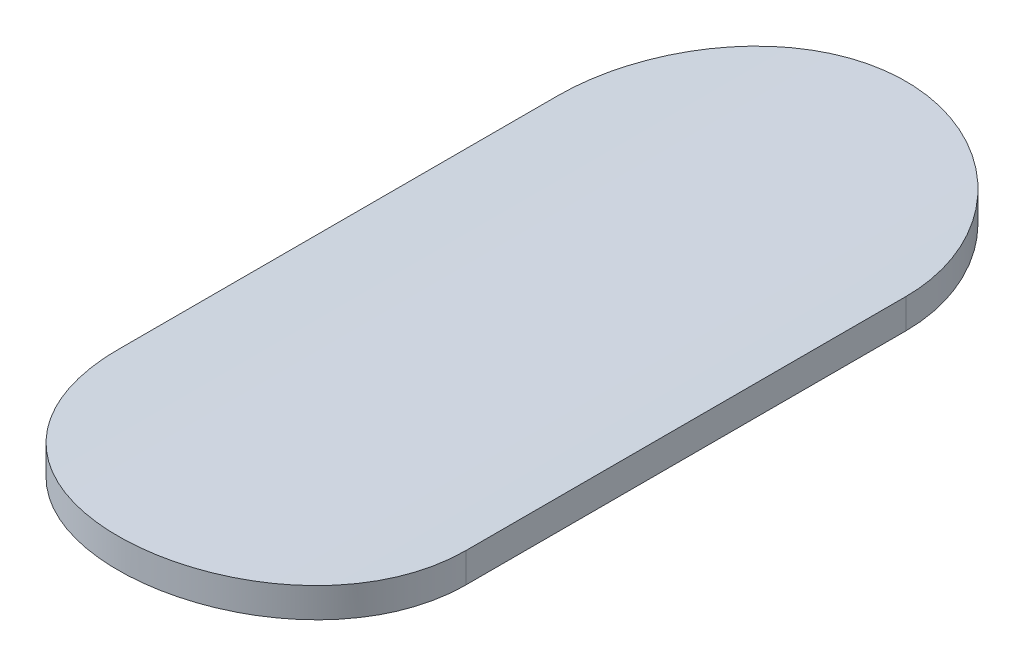
ISO-10303-21;
HEADER;
FILE_DESCRIPTION(('STEP AP214'),'2;1');
FILE_NAME('part.step','',(''),(''),'','','');
FILE_SCHEMA(('AUTOMOTIVE_DESIGN { 1 0 10303 214 1 1 1 1 }'));
ENDSEC;
DATA;
#1=APPLICATION_CONTEXT('core data for automotive mechanical design processes');
#2=APPLICATION_PROTOCOL_DEFINITION('international standard','automotive_design',2000,#1);
#3=PRODUCT_CONTEXT('',#1,'mechanical');
#4=PRODUCT('Part','Part','',(#3));
#5=PRODUCT_RELATED_PRODUCT_CATEGORY('part','',(#4));
#6=PRODUCT_DEFINITION_FORMATION('','',#4);
#7=PRODUCT_DEFINITION_CONTEXT('part definition',#1,'design');
#8=PRODUCT_DEFINITION('design','',#6,#7);
#9=PRODUCT_DEFINITION_SHAPE('','',#8);
#10=(LENGTH_UNIT() NAMED_UNIT(*) SI_UNIT(.MILLI.,.METRE.));
#11=(NAMED_UNIT(*) PLANE_ANGLE_UNIT() SI_UNIT($,.RADIAN.));
#12=(NAMED_UNIT(*) SI_UNIT($,.STERADIAN.) SOLID_ANGLE_UNIT());
#13=UNCERTAINTY_MEASURE_WITH_UNIT(LENGTH_MEASURE(1.E-05),#10,'distance_accuracy_value','');
#14=(GEOMETRIC_REPRESENTATION_CONTEXT(3) GLOBAL_UNCERTAINTY_ASSIGNED_CONTEXT((#13)) GLOBAL_UNIT_ASSIGNED_CONTEXT((#10,
#11,#12)) REPRESENTATION_CONTEXT('',''));
#15=CARTESIAN_POINT('',(0.,0.,0.));
#16=DIRECTION('',(0.,0.,1.));
#17=DIRECTION('',(1.,0.,0.));
#18=AXIS2_PLACEMENT_3D('',#15,#16,#17);
#19=CARTESIAN_POINT('',(-175.270710986936,-62.9180736437962,1.42682282483736));
#20=DIRECTION('',(0.,0.,1.));
#21=DIRECTION('',(1.,0.,0.));
#22=AXIS2_PLACEMENT_3D('',#19,#20,#21);
#23=CYLINDRICAL_SURFACE('',#22,5.);
#24=DIRECTION('',(0.,0.,1.));
#25=VECTOR('',#24,1.);
#26=CARTESIAN_POINT('',(-174.562352982167,-57.9685050830953,5.32081992476387));
#27=LINE('',#26,#25);
#28=CARTESIAN_POINT('',(-174.562352982167,-57.9685050830953,5.32081992476387));
#29=VERTEX_POINT('',#28);
#30=CARTESIAN_POINT('',(-174.562352982167,-57.9685050830953,3.52987704480574));
#31=VERTEX_POINT('',#30);
#32=EDGE_CURVE('E72',#29,#31,#27,.F.);
#33=ORIENTED_EDGE('',*,*,#32,.T.);
#34=CARTESIAN_POINT('',(-175.979068991686,-57.9685050830924,3.52987704480574));
#35=CARTESIAN_POINT('',(-175.979103782239,-57.9685236247254,3.49023832453206));
#36=CARTESIAN_POINT('',(-175.975743993142,-57.9680294172961,3.45061425502313));
#37=CARTESIAN_POINT('',(-175.962497293196,-57.966153634488,3.37253870868182));
#38=CARTESIAN_POINT('',(-175.952617865063,-57.96477307644,3.3340859403917));
#39=CARTESIAN_POINT('',(-175.926588847079,-57.9612615989124,3.25938899672191));
#40=CARTESIAN_POINT('',(-175.910437338651,-57.9591304498517,3.22314550106919));
#41=CARTESIAN_POINT('',(-175.872343788952,-57.9543645974186,3.15388484997992));
#42=CARTESIAN_POINT('',(-175.850402245911,-57.9517299373782,3.12086741727733));
#43=CARTESIAN_POINT('',(-175.801186212379,-57.9462318835381,3.05876469671133));
#44=CARTESIAN_POINT('',(-175.773879485931,-57.9433671722797,3.02970507030449));
#45=CARTESIAN_POINT('',(-175.714767078786,-57.9377429193244,2.97655491580581));
#46=CARTESIAN_POINT('',(-175.682959727318,-57.9349834171695,2.9524662412866));
#47=CARTESIAN_POINT('',(-175.615578010275,-57.9298662750011,2.90984890980622));
#48=CARTESIAN_POINT('',(-175.579986710165,-57.9275105763355,2.89134680394256));
#49=CARTESIAN_POINT('',(-175.50618961077,-57.923485599968,2.86061259257316));
#50=CARTESIAN_POINT('',(-175.46798693738,-57.9218155177829,2.84837313447103));
#51=CARTESIAN_POINT('',(-175.403100429486,-57.9197589158793,2.83349071746208));
#52=CARTESIAN_POINT('',(-175.376831486473,-57.9191299886342,2.82900786755084));
#53=CARTESIAN_POINT('',(-175.323949150309,-57.9182871387536,2.82302143781597));
#54=CARTESIAN_POINT('',(-175.297335753281,-57.9180732207935,2.821517891557));
#55=CARTESIAN_POINT('',(-175.23113654507,-57.9180742725377,2.82152074713416));
#56=CARTESIAN_POINT('',(-175.191536984771,-57.9185484483598,2.82484680154109));
#57=CARTESIAN_POINT('',(-175.113441963008,-57.9203944948015,2.83806121489377));
#58=CARTESIAN_POINT('',(-175.074947697749,-57.9217673023731,2.84795642327375));
#59=CARTESIAN_POINT('',(-175.00020677382,-57.9252561689579,2.8740088677535));
#60=CARTESIAN_POINT('',(-174.963958447437,-57.9273716685143,2.89016139127343));
#61=CARTESIAN_POINT('',(-174.894692648647,-57.9321116511947,2.92825947150867));
#62=CARTESIAN_POINT('',(-174.861674711803,-57.9347360609899,2.9502041937914));
#63=CARTESIAN_POINT('',(-174.799570755551,-57.9402220719575,2.99942664621903));
#64=CARTESIAN_POINT('',(-174.770510529491,-57.9430850497234,3.02673676787919));
#65=CARTESIAN_POINT('',(-174.717368000384,-57.9487147875815,3.08584760976762));
#66=CARTESIAN_POINT('',(-174.693286168052,-57.9514815385548,3.11764875415215));
#67=CARTESIAN_POINT('',(-174.6506815258,-57.9566194521665,3.18501383702313));
#68=CARTESIAN_POINT('',(-174.632184904988,-57.9589887286848,3.2205944762896));
#69=CARTESIAN_POINT('',(-174.601448250876,-57.9630429435686,3.29439116564338));
#70=CARTESIAN_POINT('',(-174.589204591519,-57.9647282784312,3.33260567373841));
#71=CARTESIAN_POINT('',(-174.57431847833,-57.966803740856,3.39751872626204));
#72=CARTESIAN_POINT('',(-174.569835231589,-57.9674384398505,3.42380208033447));
#73=CARTESIAN_POINT('',(-174.563852298162,-57.9682904852839,3.47667870746524));
#74=CARTESIAN_POINT('',(-174.562348814522,-57.9685083628437,3.50327154262447));
#75=CARTESIAN_POINT('',(-174.562352982166,-57.9685050830953,3.52987704480573));
#76=B_SPLINE_CURVE_WITH_KNOTS('',3,(#34,#35,#36,#37,#38,#39,#40,#41,#42,#43,#44,#45,#46,#47,#48,
#49,#50,#51,#52,#53,#54,#55,#56,#57,#58,#59,#60,#61,#62,#63,#64,#65,#66,#67,#68,#69,#70,#71,#72,
#73,#74,#75),.UNSPECIFIED.,.F.,.F.,(4,2,2,2,2,2,2,2,2,2,2,2,2,2,2,2,2,2,2,2,4),(0.,
0.118749159033301,0.237362263863266,0.356011680082907,0.474650889915931,0.594026017222665,
0.713445577112569,0.833424074530632,0.953261387365861,1.03306921841363,1.11287794856634,
1.23150381401026,1.35025356129366,1.46891404775443,1.58755744913422,1.70694043541029,
1.82633470440586,1.94628041824212,2.0661564970343,2.14600710616939,2.22575590036766),.UNSPECIFIED.);
#77=CARTESIAN_POINT('',(-175.979068991686,-57.9685050830924,3.52987704480574));
#78=VERTEX_POINT('',#77);
#79=EDGE_CURVE('E21',#78,#31,#76,.T.);
#80=ORIENTED_EDGE('',*,*,#79,.F.);
#81=DIRECTION('',(0.,0.,1.));
#82=VECTOR('',#81,1.);
#83=CARTESIAN_POINT('',(-175.979068991686,-57.9685050830924,3.52987704480574));
#84=LINE('',#83,#82);
#85=CARTESIAN_POINT('',(-175.979068991686,-57.9685050830924,5.32081992476387));
#86=VERTEX_POINT('',#85);
#87=EDGE_CURVE('E59',#78,#86,#84,.T.);
#88=ORIENTED_EDGE('',*,*,#87,.T.);
#89=CARTESIAN_POINT('',(-174.562352982166,-57.9685050830953,5.32081992476387));
#90=CARTESIAN_POINT('',(-174.562318196855,-57.9685236249812,5.36045875118215));
#91=CARTESIAN_POINT('',(-174.565678001328,-57.9680294147793,5.40008292658639));
#92=CARTESIAN_POINT('',(-174.578924730807,-57.9661536270469,5.4781584669726));
#93=CARTESIAN_POINT('',(-174.588804138273,-57.9647730715819,5.51661112942718));
#94=CARTESIAN_POINT('',(-174.614832862514,-57.961261635449,5.5913071988421));
#95=CARTESIAN_POINT('',(-174.630983984776,-57.9591305387335,5.62754996614367));
#96=CARTESIAN_POINT('',(-174.669077252271,-57.9543647067664,5.69681074350064));
#97=CARTESIAN_POINT('',(-174.69101913913,-57.9517299939867,5.72982889734272));
#98=CARTESIAN_POINT('',(-174.740238554018,-57.9462315808069,5.79193570801102));
#99=CARTESIAN_POINT('',(-174.767548788613,-57.9433665437922,5.82099833037872));
#100=CARTESIAN_POINT('',(-174.826661623317,-57.9377423080897,5.8741473371765));
#101=CARTESIAN_POINT('',(-174.858464907965,-57.9349831256108,5.89823296195578));
#102=CARTESIAN_POINT('',(-174.92582690985,-57.9298676599314,5.94083672096566));
#103=CARTESIAN_POINT('',(-174.961401022296,-57.92751314,5.95933074329458));
#104=CARTESIAN_POINT('',(-175.035187236117,-57.923487367333,5.99007073367099));
#105=CARTESIAN_POINT('',(-175.073399058509,-57.9218160424669,6.00231736133994));
#106=CARTESIAN_POINT('',(-175.151106698599,-57.9193542972137,6.02013689817477));
#107=CARTESIAN_POINT('',(-175.190592217577,-57.9185580590577,6.02575390124894));
#108=CARTESIAN_POINT('',(-175.269953805239,-57.9179162798542,6.03029159454111));
#109=CARTESIAN_POINT('',(-175.309829863807,-57.9180707142472,6.02921245774644));
#110=CARTESIAN_POINT('',(-175.388537947523,-57.9193082454885,6.02042324927957));
#111=CARTESIAN_POINT('',(-175.427375409613,-57.920384673506,6.01276079389286));
#112=CARTESIAN_POINT('',(-175.503207417969,-57.9233377917455,5.99109712979044));
#113=CARTESIAN_POINT('',(-175.540201931684,-57.9252144960957,5.97709580916648));
#114=CARTESIAN_POINT('',(-175.611444073484,-57.9295688237722,5.94310217437236));
#115=CARTESIAN_POINT('',(-175.645681859745,-57.9320484831862,5.92308950574416));
#116=CARTESIAN_POINT('',(-175.710329759436,-57.9373318406016,5.87765687959292));
#117=CARTESIAN_POINT('',(-175.74073980229,-57.9401355445759,5.85223682239285));
#118=CARTESIAN_POINT('',(-175.797147098611,-57.9457827135757,5.79644921190766));
#119=CARTESIAN_POINT('',(-175.82310390147,-57.948626312746,5.76604076055398));
#120=CARTESIAN_POINT('',(-175.869559674625,-57.9540098748136,5.7012667126286));
#121=CARTESIAN_POINT('',(-175.890057049346,-57.9565497488248,5.66689996339818));
#122=CARTESIAN_POINT('',(-175.925016270059,-57.961038558067,5.59514016548331));
#123=CARTESIAN_POINT('',(-175.939470714414,-57.9629867678086,5.55774347210168));
#124=CARTESIAN_POINT('',(-175.961861661342,-57.9660598482314,5.48104617640931));
#125=CARTESIAN_POINT('',(-175.969807949566,-57.9671859547474,5.44174852695425));
#126=CARTESIAN_POINT('',(-175.975949999032,-57.9680595995501,5.38860509983588));
#127=CARTESIAN_POINT('',(-175.977120153473,-57.9682265264066,5.37506300564646));
#128=CARTESIAN_POINT('',(-175.978678612888,-57.9684491444337,5.3479558509372));
#129=CARTESIAN_POINT('',(-175.979068231016,-57.9685050224287,5.33439086748176));
#130=CARTESIAN_POINT('',(-175.979068991686,-57.9685050830924,5.32081992476387));
#131=B_SPLINE_CURVE_WITH_KNOTS('',3,(#89,#90,#91,#92,#93,#94,#95,#96,#97,#98,#99,#100,#101,#102,
#103,#104,#105,#106,#107,#108,#109,#110,#111,#112,#113,#114,#115,#116,#117,#118,#119,#120,#121,
#122,#123,#124,#125,#126,#127,#128,#129,#130),.UNSPECIFIED.,.F.,.F.,(4,2,2,2,2,2,2,2,2,2,2,2,2,
2,2,2,2,2,2,2,4),(0.,0.118749475652926,0.23736226385581,0.356009223373578,0.474650889962775,
0.594039129072954,0.713445577251894,0.833359813547286,0.953261386262477,1.07236091244361,
1.19145736183336,1.30969958496657,1.4279438956653,1.54659318409006,1.66524465982466,
1.78492258189405,1.90463544277968,2.02449450646763,2.14417301772138,2.18493687446288,
2.22563209338629),.UNSPECIFIED.);
#132=EDGE_CURVE('E73',#29,#86,#131,.T.);
#133=ORIENTED_EDGE('',*,*,#132,.F.);
#134=EDGE_LOOP('',(#33,#80,#88,#133));
#135=FACE_BOUND('',#134,.T.);
#136=ADVANCED_FACE('F17',(#135),#23,.T.);
#137=CARTESIAN_POINT('',(-174.562352982167,-67.7980736437962,5.32081992476387));
#138=DIRECTION('',(-1.,0.,0.));
#139=DIRECTION('',(0.,0.,1.));
#140=AXIS2_PLACEMENT_3D('',#137,#138,#139);
#141=PLANE('',#140);
#142=DIRECTION('',(0.,0.,1.));
#143=VECTOR('',#142,1.);
#144=CARTESIAN_POINT('',(-174.562352982167,-58.0897583126399,1.42682282483736));
#145=LINE('',#144,#143);
#146=CARTESIAN_POINT('',(-174.562352982167,-58.0897583126399,5.32081992476387));
#147=VERTEX_POINT('',#146);
#148=CARTESIAN_POINT('',(-174.562352982166,-58.0897583126399,3.52987704480574));
#149=VERTEX_POINT('',#148);
#150=EDGE_CURVE('E80',#147,#149,#145,.F.);
#151=ORIENTED_EDGE('',*,*,#150,.T.);
#152=DIRECTION('',(0.,-1.,0.));
#153=VECTOR('',#152,1.);
#154=CARTESIAN_POINT('',(-174.562352982166,-67.7980736437962,3.52987704480574));
#155=LINE('',#154,#153);
#156=EDGE_CURVE('E67',#31,#149,#155,.T.);
#157=ORIENTED_EDGE('',*,*,#156,.F.);
#158=ORIENTED_EDGE('',*,*,#32,.F.);
#159=DIRECTION('',(0.,-1.,0.));
#160=VECTOR('',#159,1.);
#161=CARTESIAN_POINT('',(-174.562352982166,-67.7980736437962,5.32081992476387));
#162=LINE('',#161,#160);
#163=EDGE_CURVE('E106',#147,#29,#162,.F.);
#164=ORIENTED_EDGE('',*,*,#163,.F.);
#165=EDGE_LOOP('',(#151,#157,#158,#164));
#166=FACE_BOUND('',#165,.T.);
#167=ADVANCED_FACE('F79',(#166),#141,.F.);
#168=CARTESIAN_POINT('',(-175.270710986926,-67.7980736437962,3.52987704480574));
#169=DIRECTION('',(0.,-1.,0.));
#170=DIRECTION('',(0.,0.,-1.));
#171=AXIS2_PLACEMENT_3D('',#168,#169,#170);
#172=CYLINDRICAL_SURFACE('',#171,0.70835800475956);
#173=CARTESIAN_POINT('',(-174.562352982166,-58.0897583126399,3.52987704480574));
#174=CARTESIAN_POINT('',(-174.562318145192,-58.0897773193201,3.49024886650507));
#175=CARTESIAN_POINT('',(-174.565676203015,-58.08927096035,3.45063556734346));
#176=CARTESIAN_POINT('',(-174.578915443137,-58.0873491673323,3.37258243449568));
#177=CARTESIAN_POINT('',(-174.588789010642,-58.0859347945491,3.33414128569917));
#178=CARTESIAN_POINT('',(-174.614801587028,-58.0823374833905,3.25946748012301));
#179=CARTESIAN_POINT('',(-174.630942457541,-58.0801543166715,3.22323548325057));
#180=CARTESIAN_POINT('',(-174.669010037604,-58.0752722557907,3.15399550402425));
#181=CARTESIAN_POINT('',(-174.690936293546,-58.0725734020663,3.12098726918666));
#182=CARTESIAN_POINT('',(-174.740125485577,-58.0669404371566,3.05888923834984));
#183=CARTESIAN_POINT('',(-174.767422266731,-58.0640049075348,3.02982637827104));
#184=CARTESIAN_POINT('',(-174.82651525976,-58.0582413500385,2.9766673097004));
#185=CARTESIAN_POINT('',(-174.858313140636,-58.0554133625363,2.95257295170012));
#186=CARTESIAN_POINT('',(-174.925685273022,-58.0501681877257,2.90993686663457));
#187=CARTESIAN_POINT('',(-174.961277260925,-58.0477530806871,2.89142291868933));
#188=CARTESIAN_POINT('',(-175.035079792095,-58.0436261621541,2.86066588880392));
#189=CARTESIAN_POINT('',(-175.07328720302,-58.0419135259697,2.84841544941003));
#190=CARTESIAN_POINT('',(-175.138202076931,-58.0398034946585,2.83351253016731));
#191=CARTESIAN_POINT('',(-175.16449415223,-58.0391579362257,2.8290215394801));
#192=CARTESIAN_POINT('',(-175.217424022199,-58.0382927919898,2.82302420335033));
#193=CARTESIAN_POINT('',(-175.244061820581,-58.0380732107632,2.82151788997349));
#194=CARTESIAN_POINT('',(-175.310274654982,-58.0380742866822,2.82152074745773));
#195=CARTESIAN_POINT('',(-175.349863378852,-58.0385598569111,2.82484501335421));
#196=CARTESIAN_POINT('',(-175.427936533766,-58.0404502747864,2.83805198736791));
#197=CARTESIAN_POINT('',(-175.466419770955,-58.0418560799469,2.84794152687286));
#198=CARTESIAN_POINT('',(-175.541138489993,-58.0454288657007,2.87397803814451));
#199=CARTESIAN_POINT('',(-175.577375672869,-58.0475952617715,2.89012020567841));
#200=CARTESIAN_POINT('',(-175.646621247396,-58.0524495488446,2.92819290906301));
#201=CARTESIAN_POINT('',(-175.679630093273,-58.055137366324,2.95012262899791));
#202=CARTESIAN_POINT('',(-175.741729067073,-58.0607573211743,2.99931850219564));
#203=CARTESIAN_POINT('',(-175.770792178326,-58.063690940301,3.02661859038455));
#204=CARTESIAN_POINT('',(-175.823942987292,-58.0694603501512,3.08570973872547));
#205=CARTESIAN_POINT('',(-175.848030209036,-58.0722961314945,3.11750122801355));
#206=CARTESIAN_POINT('',(-175.890653310522,-58.0775636929584,3.18485660835747));
#207=CARTESIAN_POINT('',(-175.909161713932,-58.0799934480326,3.22043803920271));
#208=CARTESIAN_POINT('',(-175.939921017347,-58.0841518042721,3.29424027810761));
#209=CARTESIAN_POINT('',(-175.952175565706,-58.0858808141145,3.33245953251329));
#210=CARTESIAN_POINT('',(-175.96708191367,-58.0880111303492,3.39740055481372));
#211=CARTESIAN_POINT('',(-175.97157317901,-58.0886629126216,3.42370661294328));
#212=CARTESIAN_POINT('',(-175.977566939665,-58.0895379244265,3.47663017999317));
#213=CARTESIAN_POINT('',(-175.979073204289,-58.089761694419,3.50324725337824));
#214=CARTESIAN_POINT('',(-175.979068991686,-58.089758312637,3.52987704480574));
#215=B_SPLINE_CURVE_WITH_KNOTS('',3,(#173,#174,#175,#176,#177,#178,#179,#180,#181,#182,#183,
#184,#185,#186,#187,#188,#189,#190,#191,#192,#193,#194,#195,#196,#197,#198,#199,#200,#201,#202,
#203,#204,#205,#206,#207,#208,#209,#210,#211,#212,#213,#214),.UNSPECIFIED.,.F.,.F.,(4,2,2,2,2,2,
2,2,2,2,2,2,2,2,2,2,2,2,2,2,4),(0.,0.118717120276493,0.237295738850518,0.355909606852675,
0.474514177602681,0.593891627579886,0.713313459053198,0.833320307373828,0.953185863457887,
1.03306677770104,1.11294855013581,1.23154197581433,1.35025899575979,1.46888497935198,
1.58749424825162,1.70687857869044,1.82627432356575,1.94624884332542,2.06615329248612,
2.14607569142816,2.22589710390241),.UNSPECIFIED.);
#216=CARTESIAN_POINT('',(-175.979068991686,-58.089758312637,3.52987704480574));
#217=VERTEX_POINT('',#216);
#218=EDGE_CURVE('E91',#149,#217,#215,.T.);
#219=ORIENTED_EDGE('',*,*,#218,.T.);
#220=DIRECTION('',(0.,1.,0.));
#221=VECTOR('',#220,1.);
#222=CARTESIAN_POINT('',(-175.979068991686,-67.7980736437962,3.52987704480574));
#223=LINE('',#222,#221);
#224=EDGE_CURVE('E69',#217,#78,#223,.T.);
#225=ORIENTED_EDGE('',*,*,#224,.T.);
#226=ORIENTED_EDGE('',*,*,#79,.T.);
#227=ORIENTED_EDGE('',*,*,#156,.T.);
#228=EDGE_LOOP('',(#219,#225,#226,#227));
#229=FACE_BOUND('',#228,.T.);
#230=ADVANCED_FACE('F65',(#229),#172,.T.);
#231=CARTESIAN_POINT('',(-175.979068991686,-67.7980736437962,3.52987704480574));
#232=DIRECTION('',(1.,0.,0.));
#233=DIRECTION('',(0.,1.,0.));
#234=AXIS2_PLACEMENT_3D('',#231,#232,#233);
#235=PLANE('',#234);
#236=DIRECTION('',(0.,0.,1.));
#237=VECTOR('',#236,1.);
#238=CARTESIAN_POINT('',(-175.979068991686,-58.089758312637,1.42682282483736));
#239=LINE('',#238,#237);
#240=CARTESIAN_POINT('',(-175.979068991686,-58.089758312637,5.32081992476387));
#241=VERTEX_POINT('',#240);
#242=EDGE_CURVE('E31',#217,#241,#239,.T.);
#243=ORIENTED_EDGE('',*,*,#242,.T.);
#244=DIRECTION('',(0.,-1.,0.));
#245=VECTOR('',#244,1.);
#246=CARTESIAN_POINT('',(-175.979068991686,-67.7980736437962,5.32081992476387));
#247=LINE('',#246,#245);
#248=EDGE_CURVE('E39',#86,#241,#247,.T.);
#249=ORIENTED_EDGE('',*,*,#248,.F.);
#250=ORIENTED_EDGE('',*,*,#87,.F.);
#251=ORIENTED_EDGE('',*,*,#224,.F.);
#252=EDGE_LOOP('',(#243,#249,#250,#251));
#253=FACE_BOUND('',#252,.T.);
#254=ADVANCED_FACE('F101',(#253),#235,.F.);
#255=CARTESIAN_POINT('',(-175.270710986926,-67.7980736437962,5.32081992476387));
#256=DIRECTION('',(0.,-1.,0.));
#257=DIRECTION('',(0.,0.,-1.));
#258=AXIS2_PLACEMENT_3D('',#255,#256,#257);
#259=CYLINDRICAL_SURFACE('',#258,0.708358004759557);
#260=ORIENTED_EDGE('',*,*,#248,.T.);
#261=CARTESIAN_POINT('',(-175.979068991686,-58.089758312637,5.32081992476387));
#262=CARTESIAN_POINT('',(-175.979103823422,-58.089777319574,5.36044820732117));
#263=CARTESIAN_POINT('',(-175.975745750546,-58.0892709578118,5.40006161049683));
#264=CARTESIAN_POINT('',(-175.962506481514,-58.0873491598355,5.47811473749593));
#265=CARTESIAN_POINT('',(-175.95263293435,-58.0859347896514,5.51655578233965));
#266=CARTESIAN_POINT('',(-175.926620649955,-58.0823375206806,5.59122871845484));
#267=CARTESIAN_POINT('',(-175.910480163927,-58.080154407391,5.62745998981785));
#268=CARTESIAN_POINT('',(-175.872412864946,-58.0752723673979,5.69670009476122));
#269=CARTESIAN_POINT('',(-175.850486266801,-58.0725734598442,5.72970904790753));
#270=CARTESIAN_POINT('',(-175.801293703093,-58.0669401276507,5.79181115880727));
#271=CARTESIAN_POINT('',(-175.773993422692,-58.0640042649696,5.8208770084724));
#272=CARTESIAN_POINT('',(-175.714900003614,-58.0582407250715,5.87403493241741));
#273=CARTESIAN_POINT('',(-175.683106180024,-58.0554130644304,5.898126247091));
#274=CARTESIAN_POINT('',(-175.615753729842,-58.0501696054497,5.94074877359416));
#275=CARTESIAN_POINT('',(-175.580178905353,-58.0477557051986,5.95925464293624));
#276=CARTESIAN_POINT('',(-175.506387254001,-58.0436279722352,5.99001744414702));
#277=CARTESIAN_POINT('',(-175.468170712112,-58.0419140641492,6.00227504885032));
#278=CARTESIAN_POINT('',(-175.39046313538,-58.0393894670185,6.02011132257638));
#279=CARTESIAN_POINT('',(-175.35098292746,-58.0385725234619,6.02573626165029));
#280=CARTESIAN_POINT('',(-175.271630174833,-58.0379124748554,6.03029117701213));
#281=CARTESIAN_POINT('',(-175.231757641233,-58.0380693423135,6.02922134230275));
#282=CARTESIAN_POINT('',(-175.153069673762,-58.0393342663878,6.0204534682476));
#283=CARTESIAN_POINT('',(-175.114248541565,-58.0404351533811,6.01280538791542));
#284=CARTESIAN_POINT('',(-175.03844682072,-58.0434564145514,5.99117651597763));
#285=CARTESIAN_POINT('',(-175.001466266198,-58.0453768039163,5.97719560700348));
#286=CARTESIAN_POINT('',(-174.930242628722,-58.0498336710433,5.94324611676231));
#287=CARTESIAN_POINT('',(-174.896009823764,-58.0523723305698,5.92325627118378));
#288=CARTESIAN_POINT('',(-174.831367065206,-58.0577824317954,5.87787262590443));
#289=CARTESIAN_POINT('',(-174.800957194745,-58.0606538807293,5.85247870870903));
#290=CARTESIAN_POINT('',(-174.744531485747,-58.0664400559038,5.79673310162075));
#291=CARTESIAN_POINT('',(-174.718558087852,-58.0693549382976,5.76633845638474));
#292=CARTESIAN_POINT('',(-174.672066609499,-58.0748748078838,5.70158819558154));
#293=CARTESIAN_POINT('',(-174.651550118273,-58.0774797046763,5.66723143028101));
#294=CARTESIAN_POINT('',(-174.616549952037,-58.0820849560942,5.59548457151749));
#295=CARTESIAN_POINT('',(-174.602074000494,-58.0840845358671,5.55809066724739));
#296=CARTESIAN_POINT('',(-174.579640553982,-58.0872401588722,5.48139337006159));
#297=CARTESIAN_POINT('',(-174.571673278662,-58.088397467468,5.44209293651802));
#298=CARTESIAN_POINT('',(-174.565498181792,-58.0892978114293,5.38888866357353));
#299=CARTESIAN_POINT('',(-174.564318200676,-58.0894703629799,5.37529017740829));
#300=CARTESIAN_POINT('',(-174.562746644232,-58.0897004871427,5.34806971736497));
#301=CARTESIAN_POINT('',(-174.56235374427,-58.0897582529345,5.33444782163047));
#302=CARTESIAN_POINT('',(-174.562352982166,-58.0897583126399,5.32081992476387));
#303=B_SPLINE_CURVE_WITH_KNOTS('',3,(#261,#262,#263,#264,#265,#266,#267,#268,#269,#270,#271,
#272,#273,#274,#275,#276,#277,#278,#279,#280,#281,#282,#283,#284,#285,#286,#287,#288,#289,#290,
#291,#292,#293,#294,#295,#296,#297,#298,#299,#300,#301,#302),.UNSPECIFIED.,.F.,.F.,(4,2,2,2,2,2,
2,2,2,2,2,2,2,2,2,2,2,2,2,2,4),(0.,0.118717431269429,0.237295738843079,0.355907159656692,
0.474514177652005,0.593904709750239,0.713313459197991,0.833256120025183,0.953185862284587,
1.07227391925402,1.19135861421854,1.30954681700366,1.42773721030193,1.5463508783698,
1.66496712558317,1.78466126314287,1.90439022152268,2.02427180038265,2.14397290448866,
2.18490777514715,2.22577369557208),.UNSPECIFIED.);
#304=EDGE_CURVE('E11',#241,#147,#303,.T.);
#305=ORIENTED_EDGE('',*,*,#304,.T.);
#306=ORIENTED_EDGE('',*,*,#163,.T.);
#307=ORIENTED_EDGE('',*,*,#132,.T.);
#308=EDGE_LOOP('',(#260,#305,#306,#307));
#309=FACE_BOUND('',#308,.T.);
#310=ADVANCED_FACE('F97',(#309),#259,.T.);
#311=CARTESIAN_POINT('',(-175.270710986936,-62.9180736437962,1.42682282483736));
#312=DIRECTION('',(0.,0.,1.));
#313=DIRECTION('',(1.,0.,0.));
#314=AXIS2_PLACEMENT_3D('',#311,#312,#313);
#315=CYLINDRICAL_SURFACE('',#314,4.88);
#316=ORIENTED_EDGE('',*,*,#242,.F.);
#317=ORIENTED_EDGE('',*,*,#218,.F.);
#318=ORIENTED_EDGE('',*,*,#150,.F.);
#319=ORIENTED_EDGE('',*,*,#304,.F.);
#320=EDGE_LOOP('',(#316,#317,#318,#319));
#321=FACE_BOUND('',#320,.T.);
#322=ADVANCED_FACE('F95',(#321),#315,.F.);
#323=CLOSED_SHELL('',(#136,#167,#230,#254,#310,#322));
#324=MANIFOLD_SOLID_BREP('B1',#323);
#325=ADVANCED_BREP_SHAPE_REPRESENTATION('',(#18,#324),#14);
#326=SHAPE_DEFINITION_REPRESENTATION(#9,#325);
ENDSEC;
END-ISO-10303-21;
